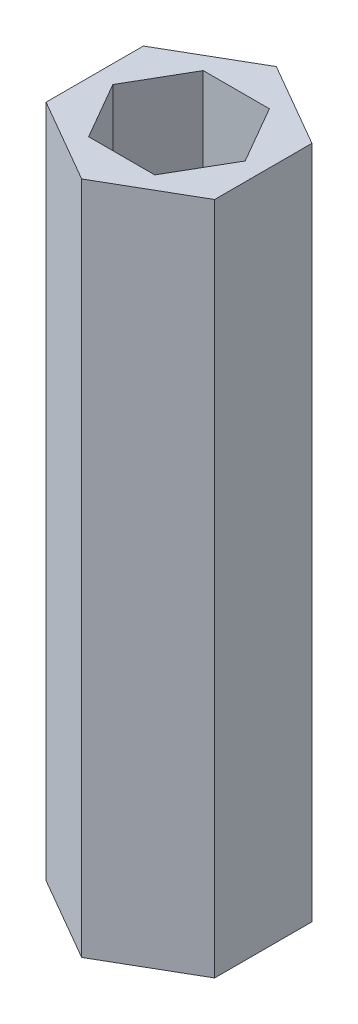
ISO-10303-21;
HEADER;
FILE_DESCRIPTION(('STEP AP214'),'2;1');
FILE_NAME('part.step','',(''),(''),'','','');
FILE_SCHEMA(('AUTOMOTIVE_DESIGN { 1 0 10303 214 1 1 1 1 }'));
ENDSEC;
DATA;
#1=APPLICATION_CONTEXT('core data for automotive mechanical design processes');
#2=APPLICATION_PROTOCOL_DEFINITION('international standard','automotive_design',2000,#1);
#3=PRODUCT_CONTEXT('',#1,'mechanical');
#4=PRODUCT('Part','Part','',(#3));
#5=PRODUCT_RELATED_PRODUCT_CATEGORY('part','',(#4));
#6=PRODUCT_DEFINITION_FORMATION('','',#4);
#7=PRODUCT_DEFINITION_CONTEXT('part definition',#1,'design');
#8=PRODUCT_DEFINITION('design','',#6,#7);
#9=PRODUCT_DEFINITION_SHAPE('','',#8);
#10=(LENGTH_UNIT() NAMED_UNIT(*) SI_UNIT(.MILLI.,.METRE.));
#11=(NAMED_UNIT(*) PLANE_ANGLE_UNIT() SI_UNIT($,.RADIAN.));
#12=(NAMED_UNIT(*) SI_UNIT($,.STERADIAN.) SOLID_ANGLE_UNIT());
#13=UNCERTAINTY_MEASURE_WITH_UNIT(LENGTH_MEASURE(1.E-05),#10,'distance_accuracy_value','');
#14=(GEOMETRIC_REPRESENTATION_CONTEXT(3) GLOBAL_UNCERTAINTY_ASSIGNED_CONTEXT((#13)) GLOBAL_UNIT_ASSIGNED_CONTEXT((#10,
#11,#12)) REPRESENTATION_CONTEXT('',''));
#15=CARTESIAN_POINT('',(0.,0.,0.));
#16=DIRECTION('',(0.,0.,1.));
#17=DIRECTION('',(1.,0.,0.));
#18=AXIS2_PLACEMENT_3D('',#15,#16,#17);
#19=CARTESIAN_POINT('',(0.,76.2,0.));
#20=DIRECTION('',(0.,1.,0.));
#21=DIRECTION('',(0.,0.,1.));
#22=AXIS2_PLACEMENT_3D('',#19,#20,#21);
#23=PLANE('',#22);
#24=DIRECTION('',(0.866025403784439,0.,0.5));
#25=VECTOR('',#24,1.);
#26=CARTESIAN_POINT('',(-9.525,76.2,5.49926131403118));
#27=LINE('',#26,#25);
#28=CARTESIAN_POINT('',(-9.525,76.2,5.49926131403118));
#29=VERTEX_POINT('',#28);
#30=CARTESIAN_POINT('',(0.,76.2,10.9985226280624));
#31=VERTEX_POINT('',#30);
#32=EDGE_CURVE('E183',#29,#31,#27,.T.);
#33=ORIENTED_EDGE('',*,*,#32,.T.);
#34=DIRECTION('',(0.866025403784438,0.,-0.5));
#35=VECTOR('',#34,1.);
#36=CARTESIAN_POINT('',(0.,76.2,10.9985226280624));
#37=LINE('',#36,#35);
#38=CARTESIAN_POINT('',(9.525,76.2,5.49926131403118));
#39=VERTEX_POINT('',#38);
#40=EDGE_CURVE('E186',#31,#39,#37,.T.);
#41=ORIENTED_EDGE('',*,*,#40,.T.);
#42=DIRECTION('',(0.,0.,-1.));
#43=VECTOR('',#42,1.);
#44=CARTESIAN_POINT('',(9.525,76.2,5.49926131403118));
#45=LINE('',#44,#43);
#46=CARTESIAN_POINT('',(9.525,76.2,-5.49926131403119));
#47=VERTEX_POINT('',#46);
#48=EDGE_CURVE('E189',#39,#47,#45,.T.);
#49=ORIENTED_EDGE('',*,*,#48,.T.);
#50=DIRECTION('',(-0.866025403784439,0.,-0.5));
#51=VECTOR('',#50,1.);
#52=CARTESIAN_POINT('',(9.525,76.2,-5.49926131403119));
#53=LINE('',#52,#51);
#54=CARTESIAN_POINT('',(0.,76.2,-10.9985226280624));
#55=VERTEX_POINT('',#54);
#56=EDGE_CURVE('E191',#47,#55,#53,.T.);
#57=ORIENTED_EDGE('',*,*,#56,.T.);
#58=DIRECTION('',(-0.866025403784439,0.,0.5));
#59=VECTOR('',#58,1.);
#60=CARTESIAN_POINT('',(0.,76.2,-10.9985226280624));
#61=LINE('',#60,#59);
#62=CARTESIAN_POINT('',(-9.525,76.2,-5.49926131403119));
#63=VERTEX_POINT('',#62);
#64=EDGE_CURVE('E193',#55,#63,#61,.T.);
#65=ORIENTED_EDGE('',*,*,#64,.T.);
#66=DIRECTION('',(0.,0.,1.));
#67=VECTOR('',#66,1.);
#68=CARTESIAN_POINT('',(-9.525,76.2,-5.49926131403119));
#69=LINE('',#68,#67);
#70=EDGE_CURVE('E195',#63,#29,#69,.T.);
#71=ORIENTED_EDGE('',*,*,#70,.T.);
#72=EDGE_LOOP('',(#33,#41,#49,#57,#65,#71));
#73=FACE_BOUND('',#72,.T.);
#74=DIRECTION('',(-1.,0.,0.));
#75=VECTOR('',#74,1.);
#76=CARTESIAN_POINT('',(3.7394976935412,76.2,-6.477));
#77=LINE('',#76,#75);
#78=CARTESIAN_POINT('',(3.7394976935412,76.2,-6.477));
#79=VERTEX_POINT('',#78);
#80=CARTESIAN_POINT('',(-3.73949769354121,76.2,-6.477));
#81=VERTEX_POINT('',#80);
#82=EDGE_CURVE('E140',#79,#81,#77,.T.);
#83=ORIENTED_EDGE('',*,*,#82,.F.);
#84=DIRECTION('',(-0.5,0.,-0.866025403784438));
#85=VECTOR('',#84,1.);
#86=CARTESIAN_POINT('',(7.47899538708241,76.2,0.));
#87=LINE('',#86,#85);
#88=CARTESIAN_POINT('',(7.47899538708241,76.2,0.));
#89=VERTEX_POINT('',#88);
#90=EDGE_CURVE('E132',#89,#79,#87,.T.);
#91=ORIENTED_EDGE('',*,*,#90,.F.);
#92=DIRECTION('',(0.5,0.,-0.866025403784439));
#93=VECTOR('',#92,1.);
#94=CARTESIAN_POINT('',(3.73949769354121,76.2,6.477));
#95=LINE('',#94,#93);
#96=CARTESIAN_POINT('',(3.73949769354121,76.2,6.477));
#97=VERTEX_POINT('',#96);
#98=EDGE_CURVE('E161',#97,#89,#95,.T.);
#99=ORIENTED_EDGE('',*,*,#98,.F.);
#100=DIRECTION('',(1.,0.,0.));
#101=VECTOR('',#100,1.);
#102=CARTESIAN_POINT('',(-3.7394976935412,76.2,6.477));
#103=LINE('',#102,#101);
#104=CARTESIAN_POINT('',(-3.7394976935412,76.2,6.477));
#105=VERTEX_POINT('',#104);
#106=EDGE_CURVE('E159',#105,#97,#103,.T.);
#107=ORIENTED_EDGE('',*,*,#106,.F.);
#108=DIRECTION('',(0.5,0.,0.866025403784439));
#109=VECTOR('',#108,1.);
#110=CARTESIAN_POINT('',(-7.47899538708241,76.2,0.));
#111=LINE('',#110,#109);
#112=CARTESIAN_POINT('',(-7.47899538708241,76.2,0.));
#113=VERTEX_POINT('',#112);
#114=EDGE_CURVE('E155',#113,#105,#111,.T.);
#115=ORIENTED_EDGE('',*,*,#114,.F.);
#116=DIRECTION('',(-0.5,0.,0.866025403784439));
#117=VECTOR('',#116,1.);
#118=CARTESIAN_POINT('',(-3.73949769354121,76.2,-6.477));
#119=LINE('',#118,#117);
#120=EDGE_CURVE('E153',#81,#113,#119,.T.);
#121=ORIENTED_EDGE('',*,*,#120,.F.);
#122=EDGE_LOOP('',(#83,#91,#99,#107,#115,#121));
#123=FACE_BOUND('',#122,.T.);
#124=ADVANCED_FACE('F43',(#73,#123),#23,.T.);
#125=CARTESIAN_POINT('',(0.,0.,0.));
#126=DIRECTION('',(0.,1.,0.));
#127=DIRECTION('',(0.,0.,1.));
#128=AXIS2_PLACEMENT_3D('',#125,#126,#127);
#129=PLANE('',#128);
#130=DIRECTION('',(0.866025403784439,0.,0.5));
#131=VECTOR('',#130,1.);
#132=CARTESIAN_POINT('',(-9.525,0.,5.49926131403118));
#133=LINE('',#132,#131);
#134=CARTESIAN_POINT('',(-9.525,0.,5.49926131403118));
#135=VERTEX_POINT('',#134);
#136=CARTESIAN_POINT('',(0.,0.,10.9985226280624));
#137=VERTEX_POINT('',#136);
#138=EDGE_CURVE('E148',#135,#137,#133,.T.);
#139=ORIENTED_EDGE('',*,*,#138,.F.);
#140=DIRECTION('',(0.,0.,1.));
#141=VECTOR('',#140,1.);
#142=CARTESIAN_POINT('',(-9.525,0.,-5.49926131403119));
#143=LINE('',#142,#141);
#144=CARTESIAN_POINT('',(-9.525,0.,-5.49926131403119));
#145=VERTEX_POINT('',#144);
#146=EDGE_CURVE('E187',#145,#135,#143,.T.);
#147=ORIENTED_EDGE('',*,*,#146,.F.);
#148=DIRECTION('',(-0.866025403784439,0.,0.5));
#149=VECTOR('',#148,1.);
#150=CARTESIAN_POINT('',(0.,0.,-10.9985226280624));
#151=LINE('',#150,#149);
#152=CARTESIAN_POINT('',(0.,0.,-10.9985226280624));
#153=VERTEX_POINT('',#152);
#154=EDGE_CURVE('E206',#153,#145,#151,.T.);
#155=ORIENTED_EDGE('',*,*,#154,.F.);
#156=DIRECTION('',(-0.866025403784439,0.,-0.5));
#157=VECTOR('',#156,1.);
#158=CARTESIAN_POINT('',(9.525,0.,-5.49926131403119));
#159=LINE('',#158,#157);
#160=CARTESIAN_POINT('',(9.525,0.,-5.49926131403119));
#161=VERTEX_POINT('',#160);
#162=EDGE_CURVE('E204',#161,#153,#159,.T.);
#163=ORIENTED_EDGE('',*,*,#162,.F.);
#164=DIRECTION('',(0.,0.,-1.));
#165=VECTOR('',#164,1.);
#166=CARTESIAN_POINT('',(9.525,0.,5.49926131403118));
#167=LINE('',#166,#165);
#168=CARTESIAN_POINT('',(9.525,0.,5.49926131403118));
#169=VERTEX_POINT('',#168);
#170=EDGE_CURVE('E202',#169,#161,#167,.T.);
#171=ORIENTED_EDGE('',*,*,#170,.F.);
#172=DIRECTION('',(0.866025403784438,0.,-0.5));
#173=VECTOR('',#172,1.);
#174=CARTESIAN_POINT('',(0.,0.,10.9985226280624));
#175=LINE('',#174,#173);
#176=EDGE_CURVE('E200',#137,#169,#175,.T.);
#177=ORIENTED_EDGE('',*,*,#176,.F.);
#178=EDGE_LOOP('',(#139,#147,#155,#163,#171,#177));
#179=FACE_BOUND('',#178,.T.);
#180=DIRECTION('',(-0.5,0.,-0.866025403784438));
#181=VECTOR('',#180,1.);
#182=CARTESIAN_POINT('',(7.47899538708241,0.,0.));
#183=LINE('',#182,#181);
#184=CARTESIAN_POINT('',(7.47899538708241,0.,0.));
#185=VERTEX_POINT('',#184);
#186=CARTESIAN_POINT('',(3.7394976935412,0.,-6.477));
#187=VERTEX_POINT('',#186);
#188=EDGE_CURVE('E66',#185,#187,#183,.T.);
#189=ORIENTED_EDGE('',*,*,#188,.T.);
#190=DIRECTION('',(-1.,0.,0.));
#191=VECTOR('',#190,1.);
#192=CARTESIAN_POINT('',(3.7394976935412,0.,-6.477));
#193=LINE('',#192,#191);
#194=CARTESIAN_POINT('',(-3.73949769354121,0.,-6.477));
#195=VERTEX_POINT('',#194);
#196=EDGE_CURVE('E147',#187,#195,#193,.T.);
#197=ORIENTED_EDGE('',*,*,#196,.T.);
#198=DIRECTION('',(-0.5,0.,0.866025403784439));
#199=VECTOR('',#198,1.);
#200=CARTESIAN_POINT('',(-3.73949769354121,0.,-6.477));
#201=LINE('',#200,#199);
#202=CARTESIAN_POINT('',(-7.47899538708241,0.,0.));
#203=VERTEX_POINT('',#202);
#204=EDGE_CURVE('E165',#195,#203,#201,.T.);
#205=ORIENTED_EDGE('',*,*,#204,.T.);
#206=DIRECTION('',(0.5,0.,0.866025403784439));
#207=VECTOR('',#206,1.);
#208=CARTESIAN_POINT('',(-7.47899538708241,0.,0.));
#209=LINE('',#208,#207);
#210=CARTESIAN_POINT('',(-3.7394976935412,0.,6.477));
#211=VERTEX_POINT('',#210);
#212=EDGE_CURVE('E168',#203,#211,#209,.T.);
#213=ORIENTED_EDGE('',*,*,#212,.T.);
#214=DIRECTION('',(1.,0.,0.));
#215=VECTOR('',#214,1.);
#216=CARTESIAN_POINT('',(-3.7394976935412,0.,6.477));
#217=LINE('',#216,#215);
#218=CARTESIAN_POINT('',(3.73949769354121,0.,6.477));
#219=VERTEX_POINT('',#218);
#220=EDGE_CURVE('E171',#211,#219,#217,.T.);
#221=ORIENTED_EDGE('',*,*,#220,.T.);
#222=DIRECTION('',(0.5,0.,-0.866025403784439));
#223=VECTOR('',#222,1.);
#224=CARTESIAN_POINT('',(3.73949769354121,0.,6.477));
#225=LINE('',#224,#223);
#226=EDGE_CURVE('E141',#219,#185,#225,.T.);
#227=ORIENTED_EDGE('',*,*,#226,.T.);
#228=EDGE_LOOP('',(#189,#197,#205,#213,#221,#227));
#229=FACE_BOUND('',#228,.T.);
#230=ADVANCED_FACE('F230',(#179,#229),#129,.F.);
#231=CARTESIAN_POINT('',(-9.525,76.2,5.49926131403118));
#232=DIRECTION('',(0.5,0.,-0.866025403784439));
#233=DIRECTION('',(-0.866025403784439,0.,-0.5));
#234=AXIS2_PLACEMENT_3D('',#231,#232,#233);
#235=PLANE('',#234);
#236=ORIENTED_EDGE('',*,*,#138,.T.);
#237=DIRECTION('',(0.,-1.,0.));
#238=VECTOR('',#237,1.);
#239=CARTESIAN_POINT('',(0.,76.2,10.9985226280624));
#240=LINE('',#239,#238);
#241=EDGE_CURVE('E11',#31,#137,#240,.T.);
#242=ORIENTED_EDGE('',*,*,#241,.F.);
#243=ORIENTED_EDGE('',*,*,#32,.F.);
#244=DIRECTION('',(0.,-1.,0.));
#245=VECTOR('',#244,1.);
#246=CARTESIAN_POINT('',(-9.525,76.2,5.49926131403118));
#247=LINE('',#246,#245);
#248=EDGE_CURVE('E197',#29,#135,#247,.T.);
#249=ORIENTED_EDGE('',*,*,#248,.T.);
#250=EDGE_LOOP('',(#236,#242,#243,#249));
#251=FACE_BOUND('',#250,.T.);
#252=ADVANCED_FACE('F45',(#251),#235,.F.);
#253=CARTESIAN_POINT('',(0.,76.2,10.9985226280624));
#254=DIRECTION('',(-0.5,0.,-0.866025403784439));
#255=DIRECTION('',(-0.866025403784438,0.,0.5));
#256=AXIS2_PLACEMENT_3D('',#253,#254,#255);
#257=PLANE('',#256);
#258=ORIENTED_EDGE('',*,*,#176,.T.);
#259=DIRECTION('',(0.,-1.,0.));
#260=VECTOR('',#259,1.);
#261=CARTESIAN_POINT('',(9.525,76.2,5.49926131403118));
#262=LINE('',#261,#260);
#263=EDGE_CURVE('E51',#39,#169,#262,.T.);
#264=ORIENTED_EDGE('',*,*,#263,.F.);
#265=ORIENTED_EDGE('',*,*,#40,.F.);
#266=ORIENTED_EDGE('',*,*,#241,.T.);
#267=EDGE_LOOP('',(#258,#264,#265,#266));
#268=FACE_BOUND('',#267,.T.);
#269=ADVANCED_FACE('F247',(#268),#257,.F.);
#270=CARTESIAN_POINT('',(9.525,76.2,5.49926131403118));
#271=DIRECTION('',(-1.,0.,0.));
#272=DIRECTION('',(0.,0.,1.));
#273=AXIS2_PLACEMENT_3D('',#270,#271,#272);
#274=PLANE('',#273);
#275=ORIENTED_EDGE('',*,*,#170,.T.);
#276=DIRECTION('',(0.,-1.,0.));
#277=VECTOR('',#276,1.);
#278=CARTESIAN_POINT('',(9.525,76.2,-5.49926131403119));
#279=LINE('',#278,#277);
#280=EDGE_CURVE('E217',#47,#161,#279,.T.);
#281=ORIENTED_EDGE('',*,*,#280,.F.);
#282=ORIENTED_EDGE('',*,*,#48,.F.);
#283=ORIENTED_EDGE('',*,*,#263,.T.);
#284=EDGE_LOOP('',(#275,#281,#282,#283));
#285=FACE_BOUND('',#284,.T.);
#286=ADVANCED_FACE('F224',(#285),#274,.F.);
#287=CARTESIAN_POINT('',(9.525,76.2,-5.49926131403119));
#288=DIRECTION('',(-0.5,0.,0.866025403784439));
#289=DIRECTION('',(0.866025403784439,0.,0.5));
#290=AXIS2_PLACEMENT_3D('',#287,#288,#289);
#291=PLANE('',#290);
#292=ORIENTED_EDGE('',*,*,#162,.T.);
#293=DIRECTION('',(0.,-1.,0.));
#294=VECTOR('',#293,1.);
#295=CARTESIAN_POINT('',(0.,76.2,-10.9985226280624));
#296=LINE('',#295,#294);
#297=EDGE_CURVE('E214',#55,#153,#296,.T.);
#298=ORIENTED_EDGE('',*,*,#297,.F.);
#299=ORIENTED_EDGE('',*,*,#56,.F.);
#300=ORIENTED_EDGE('',*,*,#280,.T.);
#301=EDGE_LOOP('',(#292,#298,#299,#300));
#302=FACE_BOUND('',#301,.T.);
#303=ADVANCED_FACE('F236',(#302),#291,.F.);
#304=CARTESIAN_POINT('',(0.,76.2,-10.9985226280624));
#305=DIRECTION('',(0.5,0.,0.866025403784439));
#306=DIRECTION('',(0.866025403784438,0.,-0.5));
#307=AXIS2_PLACEMENT_3D('',#304,#305,#306);
#308=PLANE('',#307);
#309=ORIENTED_EDGE('',*,*,#154,.T.);
#310=DIRECTION('',(0.,-1.,0.));
#311=VECTOR('',#310,1.);
#312=CARTESIAN_POINT('',(-9.525,76.2,-5.49926131403119));
#313=LINE('',#312,#311);
#314=EDGE_CURVE('E211',#63,#145,#313,.T.);
#315=ORIENTED_EDGE('',*,*,#314,.F.);
#316=ORIENTED_EDGE('',*,*,#64,.F.);
#317=ORIENTED_EDGE('',*,*,#297,.T.);
#318=EDGE_LOOP('',(#309,#315,#316,#317));
#319=FACE_BOUND('',#318,.T.);
#320=ADVANCED_FACE('F240',(#319),#308,.F.);
#321=CARTESIAN_POINT('',(-9.525,76.2,-5.49926131403119));
#322=DIRECTION('',(1.,0.,0.));
#323=DIRECTION('',(0.,0.,-1.));
#324=AXIS2_PLACEMENT_3D('',#321,#322,#323);
#325=PLANE('',#324);
#326=ORIENTED_EDGE('',*,*,#146,.T.);
#327=ORIENTED_EDGE('',*,*,#248,.F.);
#328=ORIENTED_EDGE('',*,*,#70,.F.);
#329=ORIENTED_EDGE('',*,*,#314,.T.);
#330=EDGE_LOOP('',(#326,#327,#328,#329));
#331=FACE_BOUND('',#330,.T.);
#332=ADVANCED_FACE('F250',(#331),#325,.F.);
#333=CARTESIAN_POINT('',(7.47899538708241,76.2,0.));
#334=DIRECTION('',(-0.866025403784439,0.,0.5));
#335=DIRECTION('',(0.5,0.,0.866025403784438));
#336=AXIS2_PLACEMENT_3D('',#333,#334,#335);
#337=PLANE('',#336);
#338=ORIENTED_EDGE('',*,*,#188,.F.);
#339=DIRECTION('',(0.,-1.,0.));
#340=VECTOR('',#339,1.);
#341=CARTESIAN_POINT('',(7.47899538708241,76.2,0.));
#342=LINE('',#341,#340);
#343=EDGE_CURVE('E136',#89,#185,#342,.T.);
#344=ORIENTED_EDGE('',*,*,#343,.F.);
#345=ORIENTED_EDGE('',*,*,#90,.T.);
#346=DIRECTION('',(0.,-1.,0.));
#347=VECTOR('',#346,1.);
#348=CARTESIAN_POINT('',(3.7394976935412,76.2,-6.477));
#349=LINE('',#348,#347);
#350=EDGE_CURVE('E135',#79,#187,#349,.T.);
#351=ORIENTED_EDGE('',*,*,#350,.T.);
#352=EDGE_LOOP('',(#338,#344,#345,#351));
#353=FACE_BOUND('',#352,.T.);
#354=ADVANCED_FACE('F134',(#353),#337,.T.);
#355=CARTESIAN_POINT('',(3.7394976935412,76.2,-6.477));
#356=DIRECTION('',(0.,0.,1.));
#357=DIRECTION('',(1.,0.,0.));
#358=AXIS2_PLACEMENT_3D('',#355,#356,#357);
#359=PLANE('',#358);
#360=ORIENTED_EDGE('',*,*,#196,.F.);
#361=ORIENTED_EDGE('',*,*,#350,.F.);
#362=ORIENTED_EDGE('',*,*,#82,.T.);
#363=DIRECTION('',(0.,-1.,0.));
#364=VECTOR('',#363,1.);
#365=CARTESIAN_POINT('',(-3.73949769354121,76.2,-6.477));
#366=LINE('',#365,#364);
#367=EDGE_CURVE('E149',#81,#195,#366,.T.);
#368=ORIENTED_EDGE('',*,*,#367,.T.);
#369=EDGE_LOOP('',(#360,#361,#362,#368));
#370=FACE_BOUND('',#369,.T.);
#371=ADVANCED_FACE('F144',(#370),#359,.T.);
#372=CARTESIAN_POINT('',(-3.73949769354121,76.2,-6.477));
#373=DIRECTION('',(0.866025403784439,0.,0.5));
#374=DIRECTION('',(0.5,0.,-0.866025403784439));
#375=AXIS2_PLACEMENT_3D('',#372,#373,#374);
#376=PLANE('',#375);
#377=ORIENTED_EDGE('',*,*,#204,.F.);
#378=ORIENTED_EDGE('',*,*,#367,.F.);
#379=ORIENTED_EDGE('',*,*,#120,.T.);
#380=DIRECTION('',(0.,-1.,0.));
#381=VECTOR('',#380,1.);
#382=CARTESIAN_POINT('',(-7.47899538708241,76.2,0.));
#383=LINE('',#382,#381);
#384=EDGE_CURVE('E180',#113,#203,#383,.T.);
#385=ORIENTED_EDGE('',*,*,#384,.T.);
#386=EDGE_LOOP('',(#377,#378,#379,#385));
#387=FACE_BOUND('',#386,.T.);
#388=ADVANCED_FACE('F268',(#387),#376,.T.);
#389=CARTESIAN_POINT('',(-7.47899538708241,76.2,0.));
#390=DIRECTION('',(0.866025403784439,0.,-0.5));
#391=DIRECTION('',(-0.5,0.,-0.866025403784438));
#392=AXIS2_PLACEMENT_3D('',#389,#390,#391);
#393=PLANE('',#392);
#394=ORIENTED_EDGE('',*,*,#212,.F.);
#395=ORIENTED_EDGE('',*,*,#384,.F.);
#396=ORIENTED_EDGE('',*,*,#114,.T.);
#397=DIRECTION('',(0.,-1.,0.));
#398=VECTOR('',#397,1.);
#399=CARTESIAN_POINT('',(-3.7394976935412,76.2,6.477));
#400=LINE('',#399,#398);
#401=EDGE_CURVE('E178',#105,#211,#400,.T.);
#402=ORIENTED_EDGE('',*,*,#401,.T.);
#403=EDGE_LOOP('',(#394,#395,#396,#402));
#404=FACE_BOUND('',#403,.T.);
#405=ADVANCED_FACE('F271',(#404),#393,.T.);
#406=CARTESIAN_POINT('',(-3.7394976935412,76.2,6.477));
#407=DIRECTION('',(0.,0.,-1.));
#408=DIRECTION('',(-1.,0.,0.));
#409=AXIS2_PLACEMENT_3D('',#406,#407,#408);
#410=PLANE('',#409);
#411=ORIENTED_EDGE('',*,*,#220,.F.);
#412=ORIENTED_EDGE('',*,*,#401,.F.);
#413=ORIENTED_EDGE('',*,*,#106,.T.);
#414=DIRECTION('',(0.,-1.,0.));
#415=VECTOR('',#414,1.);
#416=CARTESIAN_POINT('',(3.73949769354121,76.2,6.477));
#417=LINE('',#416,#415);
#418=EDGE_CURVE('E58',#97,#219,#417,.T.);
#419=ORIENTED_EDGE('',*,*,#418,.T.);
#420=EDGE_LOOP('',(#411,#412,#413,#419));
#421=FACE_BOUND('',#420,.T.);
#422=ADVANCED_FACE('F275',(#421),#410,.T.);
#423=CARTESIAN_POINT('',(3.73949769354121,76.2,6.477));
#424=DIRECTION('',(-0.866025403784439,0.,-0.5));
#425=DIRECTION('',(-0.5,0.,0.866025403784439));
#426=AXIS2_PLACEMENT_3D('',#423,#424,#425);
#427=PLANE('',#426);
#428=ORIENTED_EDGE('',*,*,#226,.F.);
#429=ORIENTED_EDGE('',*,*,#418,.F.);
#430=ORIENTED_EDGE('',*,*,#98,.T.);
#431=ORIENTED_EDGE('',*,*,#343,.T.);
#432=EDGE_LOOP('',(#428,#429,#430,#431));
#433=FACE_BOUND('',#432,.T.);
#434=ADVANCED_FACE('F279',(#433),#427,.T.);
#435=CLOSED_SHELL('',(#124,#230,#252,#269,#286,#303,#320,#332,#354,#371,#388,#405,#422,#434));
#436=MANIFOLD_SOLID_BREP('B2',#435);
#437=ADVANCED_BREP_SHAPE_REPRESENTATION('',(#18,#436),#14);
#438=SHAPE_DEFINITION_REPRESENTATION(#9,#437);
ENDSEC;
END-ISO-10303-21;
